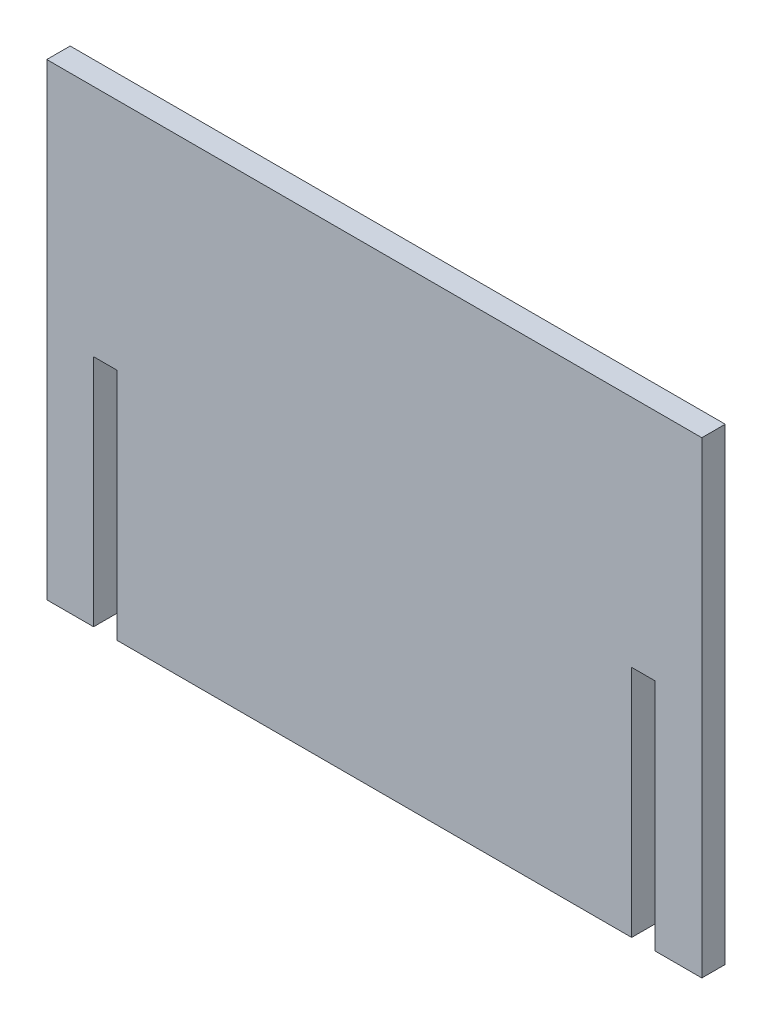
ISO-10303-21;
HEADER;
FILE_DESCRIPTION(('STEP AP214'),'2;1');
FILE_NAME('part.step','',(''),(''),'','','');
FILE_SCHEMA(('AUTOMOTIVE_DESIGN { 1 0 10303 214 1 1 1 1 }'));
ENDSEC;
DATA;
#1=APPLICATION_CONTEXT('core data for automotive mechanical design processes');
#2=APPLICATION_PROTOCOL_DEFINITION('international standard','automotive_design',2000,#1);
#3=PRODUCT_CONTEXT('',#1,'mechanical');
#4=PRODUCT('Part','Part','',(#3));
#5=PRODUCT_RELATED_PRODUCT_CATEGORY('part','',(#4));
#6=PRODUCT_DEFINITION_FORMATION('','',#4);
#7=PRODUCT_DEFINITION_CONTEXT('part definition',#1,'design');
#8=PRODUCT_DEFINITION('design','',#6,#7);
#9=PRODUCT_DEFINITION_SHAPE('','',#8);
#10=(LENGTH_UNIT() NAMED_UNIT(*) SI_UNIT(.MILLI.,.METRE.));
#11=(NAMED_UNIT(*) PLANE_ANGLE_UNIT() SI_UNIT($,.RADIAN.));
#12=(NAMED_UNIT(*) SI_UNIT($,.STERADIAN.) SOLID_ANGLE_UNIT());
#13=UNCERTAINTY_MEASURE_WITH_UNIT(LENGTH_MEASURE(1.E-05),#10,'distance_accuracy_value','');
#14=(GEOMETRIC_REPRESENTATION_CONTEXT(3) GLOBAL_UNCERTAINTY_ASSIGNED_CONTEXT((#13)) GLOBAL_UNIT_ASSIGNED_CONTEXT((#10,
#11,#12)) REPRESENTATION_CONTEXT('',''));
#15=CARTESIAN_POINT('',(0.,0.,0.));
#16=DIRECTION('',(0.,0.,1.));
#17=DIRECTION('',(1.,0.,0.));
#18=AXIS2_PLACEMENT_3D('',#15,#16,#17);
#19=CARTESIAN_POINT('',(1294.20395565763,-24.1798672236195,6.35));
#20=DIRECTION('',(1.,0.,0.));
#21=DIRECTION('',(0.,0.,-1.));
#22=AXIS2_PLACEMENT_3D('',#19,#20,#21);
#23=PLANE('',#22);
#24=DIRECTION('',(0.,-1.,0.));
#25=VECTOR('',#24,1.);
#26=CARTESIAN_POINT('',(1294.20395565763,-24.1798672236195,-6.35));
#27=LINE('',#26,#25);
#28=CARTESIAN_POINT('',(1294.20395565763,-24.1798672236195,-6.35));
#29=VERTEX_POINT('',#28);
#30=CARTESIAN_POINT('',(1294.20395565763,-278.17986722362,-6.35));
#31=VERTEX_POINT('',#30);
#32=EDGE_CURVE('E196',#29,#31,#27,.T.);
#33=ORIENTED_EDGE('',*,*,#32,.T.);
#34=DIRECTION('',(0.,0.,-1.));
#35=VECTOR('',#34,1.);
#36=CARTESIAN_POINT('',(1294.20395565763,-278.17986722362,6.35));
#37=LINE('',#36,#35);
#38=CARTESIAN_POINT('',(1294.20395565763,-278.17986722362,6.35));
#39=VERTEX_POINT('',#38);
#40=EDGE_CURVE('E11',#39,#31,#37,.T.);
#41=ORIENTED_EDGE('',*,*,#40,.F.);
#42=DIRECTION('',(0.,-1.,0.));
#43=VECTOR('',#42,1.);
#44=CARTESIAN_POINT('',(1294.20395565763,-24.1798672236195,6.35));
#45=LINE('',#44,#43);
#46=CARTESIAN_POINT('',(1294.20395565763,-24.1798672236195,6.35));
#47=VERTEX_POINT('',#46);
#48=EDGE_CURVE('E230',#47,#39,#45,.T.);
#49=ORIENTED_EDGE('',*,*,#48,.F.);
#50=DIRECTION('',(0.,0.,-1.));
#51=VECTOR('',#50,1.);
#52=CARTESIAN_POINT('',(1294.20395565763,-24.1798672236195,6.35));
#53=LINE('',#52,#51);
#54=EDGE_CURVE('E192',#47,#29,#53,.T.);
#55=ORIENTED_EDGE('',*,*,#54,.T.);
#56=EDGE_LOOP('',(#33,#41,#49,#55));
#57=FACE_BOUND('',#56,.T.);
#58=ADVANCED_FACE('F47',(#57),#23,.F.);
#59=CARTESIAN_POINT('',(1294.20395565763,-278.17986722362,6.35));
#60=DIRECTION('',(0.,1.,0.));
#61=DIRECTION('',(0.,0.,1.));
#62=AXIS2_PLACEMENT_3D('',#59,#60,#61);
#63=PLANE('',#62);
#64=DIRECTION('',(1.,0.,0.));
#65=VECTOR('',#64,1.);
#66=CARTESIAN_POINT('',(1294.20395565763,-278.17986722362,-6.35));
#67=LINE('',#66,#65);
#68=CARTESIAN_POINT('',(1319.60395565763,-278.17986722362,-6.35));
#69=VERTEX_POINT('',#68);
#70=EDGE_CURVE('E200',#31,#69,#67,.T.);
#71=ORIENTED_EDGE('',*,*,#70,.T.);
#72=DIRECTION('',(0.,0.,-1.));
#73=VECTOR('',#72,1.);
#74=CARTESIAN_POINT('',(1319.60395565763,-278.17986722362,6.35));
#75=LINE('',#74,#73);
#76=CARTESIAN_POINT('',(1319.60395565763,-278.17986722362,6.35));
#77=VERTEX_POINT('',#76);
#78=EDGE_CURVE('E56',#77,#69,#75,.T.);
#79=ORIENTED_EDGE('',*,*,#78,.F.);
#80=DIRECTION('',(1.,0.,0.));
#81=VECTOR('',#80,1.);
#82=CARTESIAN_POINT('',(1294.20395565763,-278.17986722362,6.35));
#83=LINE('',#82,#81);
#84=EDGE_CURVE('E135',#39,#77,#83,.T.);
#85=ORIENTED_EDGE('',*,*,#84,.F.);
#86=ORIENTED_EDGE('',*,*,#40,.T.);
#87=EDGE_LOOP('',(#71,#79,#85,#86));
#88=FACE_BOUND('',#87,.T.);
#89=ADVANCED_FACE('F324',(#88),#63,.F.);
#90=CARTESIAN_POINT('',(1319.60395565763,-278.17986722362,6.35));
#91=DIRECTION('',(-1.,0.,0.));
#92=DIRECTION('',(0.,0.,1.));
#93=AXIS2_PLACEMENT_3D('',#90,#91,#92);
#94=PLANE('',#93);
#95=DIRECTION('',(0.,1.,0.));
#96=VECTOR('',#95,1.);
#97=CARTESIAN_POINT('',(1319.60395565763,-278.17986722362,-6.35));
#98=LINE('',#97,#96);
#99=CARTESIAN_POINT('',(1319.60395565763,-151.17986722362,-6.35));
#100=VERTEX_POINT('',#99);
#101=EDGE_CURVE('E203',#69,#100,#98,.T.);
#102=ORIENTED_EDGE('',*,*,#101,.T.);
#103=DIRECTION('',(0.,0.,-1.));
#104=VECTOR('',#103,1.);
#105=CARTESIAN_POINT('',(1319.60395565763,-151.17986722362,6.35));
#106=LINE('',#105,#104);
#107=CARTESIAN_POINT('',(1319.60395565763,-151.17986722362,6.35));
#108=VERTEX_POINT('',#107);
#109=EDGE_CURVE('E257',#108,#100,#106,.T.);
#110=ORIENTED_EDGE('',*,*,#109,.F.);
#111=DIRECTION('',(0.,1.,0.));
#112=VECTOR('',#111,1.);
#113=CARTESIAN_POINT('',(1319.60395565763,-278.17986722362,6.35));
#114=LINE('',#113,#112);
#115=EDGE_CURVE('E267',#77,#108,#114,.T.);
#116=ORIENTED_EDGE('',*,*,#115,.F.);
#117=ORIENTED_EDGE('',*,*,#78,.T.);
#118=EDGE_LOOP('',(#102,#110,#116,#117));
#119=FACE_BOUND('',#118,.T.);
#120=ADVANCED_FACE('F265',(#119),#94,.F.);
#121=CARTESIAN_POINT('',(1319.60395565763,-151.17986722362,6.35));
#122=DIRECTION('',(0.,1.,0.));
#123=DIRECTION('',(0.,0.,1.));
#124=AXIS2_PLACEMENT_3D('',#121,#122,#123);
#125=PLANE('',#124);
#126=DIRECTION('',(1.,0.,0.));
#127=VECTOR('',#126,1.);
#128=CARTESIAN_POINT('',(1319.60395565763,-151.17986722362,-6.35));
#129=LINE('',#128,#127);
#130=CARTESIAN_POINT('',(1332.30395565763,-151.17986722362,-6.35));
#131=VERTEX_POINT('',#130);
#132=EDGE_CURVE('E206',#100,#131,#129,.T.);
#133=ORIENTED_EDGE('',*,*,#132,.T.);
#134=DIRECTION('',(0.,0.,-1.));
#135=VECTOR('',#134,1.);
#136=CARTESIAN_POINT('',(1332.30395565763,-151.17986722362,6.35));
#137=LINE('',#136,#135);
#138=CARTESIAN_POINT('',(1332.30395565763,-151.17986722362,6.35));
#139=VERTEX_POINT('',#138);
#140=EDGE_CURVE('E253',#139,#131,#137,.T.);
#141=ORIENTED_EDGE('',*,*,#140,.F.);
#142=DIRECTION('',(1.,0.,0.));
#143=VECTOR('',#142,1.);
#144=CARTESIAN_POINT('',(1319.60395565763,-151.17986722362,6.35));
#145=LINE('',#144,#143);
#146=EDGE_CURVE('E286',#108,#139,#145,.T.);
#147=ORIENTED_EDGE('',*,*,#146,.F.);
#148=ORIENTED_EDGE('',*,*,#109,.T.);
#149=EDGE_LOOP('',(#133,#141,#147,#148));
#150=FACE_BOUND('',#149,.T.);
#151=ADVANCED_FACE('F276',(#150),#125,.F.);
#152=CARTESIAN_POINT('',(1332.30395565763,-151.17986722362,6.35));
#153=DIRECTION('',(1.,0.,0.));
#154=DIRECTION('',(0.,0.,-1.));
#155=AXIS2_PLACEMENT_3D('',#152,#153,#154);
#156=PLANE('',#155);
#157=DIRECTION('',(0.,-1.,0.));
#158=VECTOR('',#157,1.);
#159=CARTESIAN_POINT('',(1332.30395565763,-151.17986722362,-6.35));
#160=LINE('',#159,#158);
#161=CARTESIAN_POINT('',(1332.30395565763,-278.17986722362,-6.35));
#162=VERTEX_POINT('',#161);
#163=EDGE_CURVE('E209',#131,#162,#160,.T.);
#164=ORIENTED_EDGE('',*,*,#163,.T.);
#165=DIRECTION('',(0.,0.,-1.));
#166=VECTOR('',#165,1.);
#167=CARTESIAN_POINT('',(1332.30395565763,-278.17986722362,6.35));
#168=LINE('',#167,#166);
#169=CARTESIAN_POINT('',(1332.30395565763,-278.17986722362,6.35));
#170=VERTEX_POINT('',#169);
#171=EDGE_CURVE('E249',#170,#162,#168,.T.);
#172=ORIENTED_EDGE('',*,*,#171,.F.);
#173=DIRECTION('',(0.,-1.,0.));
#174=VECTOR('',#173,1.);
#175=CARTESIAN_POINT('',(1332.30395565763,-151.17986722362,6.35));
#176=LINE('',#175,#174);
#177=EDGE_CURVE('E282',#139,#170,#176,.T.);
#178=ORIENTED_EDGE('',*,*,#177,.F.);
#179=ORIENTED_EDGE('',*,*,#140,.T.);
#180=EDGE_LOOP('',(#164,#172,#178,#179));
#181=FACE_BOUND('',#180,.T.);
#182=ADVANCED_FACE('F280',(#181),#156,.F.);
#183=CARTESIAN_POINT('',(1332.30395565763,-278.17986722362,6.35));
#184=DIRECTION('',(0.,1.,0.));
#185=DIRECTION('',(0.,0.,1.));
#186=AXIS2_PLACEMENT_3D('',#183,#184,#185);
#187=PLANE('',#186);
#188=DIRECTION('',(1.,0.,0.));
#189=VECTOR('',#188,1.);
#190=CARTESIAN_POINT('',(1332.30395565763,-278.17986722362,-6.35));
#191=LINE('',#190,#189);
#192=CARTESIAN_POINT('',(1611.70395565763,-278.17986722362,-6.35));
#193=VERTEX_POINT('',#192);
#194=EDGE_CURVE('E212',#162,#193,#191,.T.);
#195=ORIENTED_EDGE('',*,*,#194,.T.);
#196=DIRECTION('',(0.,0.,-1.));
#197=VECTOR('',#196,1.);
#198=CARTESIAN_POINT('',(1611.70395565763,-278.17986722362,6.35));
#199=LINE('',#198,#197);
#200=CARTESIAN_POINT('',(1611.70395565763,-278.17986722362,6.35));
#201=VERTEX_POINT('',#200);
#202=EDGE_CURVE('E245',#201,#193,#199,.T.);
#203=ORIENTED_EDGE('',*,*,#202,.F.);
#204=DIRECTION('',(1.,0.,0.));
#205=VECTOR('',#204,1.);
#206=CARTESIAN_POINT('',(1332.30395565763,-278.17986722362,6.35));
#207=LINE('',#206,#205);
#208=EDGE_CURVE('E285',#170,#201,#207,.T.);
#209=ORIENTED_EDGE('',*,*,#208,.F.);
#210=ORIENTED_EDGE('',*,*,#171,.T.);
#211=EDGE_LOOP('',(#195,#203,#209,#210));
#212=FACE_BOUND('',#211,.T.);
#213=ADVANCED_FACE('F337',(#212),#187,.F.);
#214=CARTESIAN_POINT('',(1611.70395565763,-278.17986722362,6.35));
#215=DIRECTION('',(-1.,0.,0.));
#216=DIRECTION('',(0.,0.,1.));
#217=AXIS2_PLACEMENT_3D('',#214,#215,#216);
#218=PLANE('',#217);
#219=DIRECTION('',(0.,1.,0.));
#220=VECTOR('',#219,1.);
#221=CARTESIAN_POINT('',(1611.70395565763,-278.17986722362,-6.35));
#222=LINE('',#221,#220);
#223=CARTESIAN_POINT('',(1611.70395565763,-151.17986722362,-6.35));
#224=VERTEX_POINT('',#223);
#225=EDGE_CURVE('E215',#193,#224,#222,.T.);
#226=ORIENTED_EDGE('',*,*,#225,.T.);
#227=DIRECTION('',(0.,0.,-1.));
#228=VECTOR('',#227,1.);
#229=CARTESIAN_POINT('',(1611.70395565763,-151.17986722362,6.35));
#230=LINE('',#229,#228);
#231=CARTESIAN_POINT('',(1611.70395565763,-151.17986722362,6.35));
#232=VERTEX_POINT('',#231);
#233=EDGE_CURVE('E241',#232,#224,#230,.T.);
#234=ORIENTED_EDGE('',*,*,#233,.F.);
#235=DIRECTION('',(0.,1.,0.));
#236=VECTOR('',#235,1.);
#237=CARTESIAN_POINT('',(1611.70395565763,-278.17986722362,6.35));
#238=LINE('',#237,#236);
#239=EDGE_CURVE('E290',#201,#232,#238,.T.);
#240=ORIENTED_EDGE('',*,*,#239,.F.);
#241=ORIENTED_EDGE('',*,*,#202,.T.);
#242=EDGE_LOOP('',(#226,#234,#240,#241));
#243=FACE_BOUND('',#242,.T.);
#244=ADVANCED_FACE('F340',(#243),#218,.F.);
#245=CARTESIAN_POINT('',(1611.70395565763,-151.17986722362,6.35));
#246=DIRECTION('',(0.,1.,0.));
#247=DIRECTION('',(0.,0.,1.));
#248=AXIS2_PLACEMENT_3D('',#245,#246,#247);
#249=PLANE('',#248);
#250=DIRECTION('',(1.,0.,0.));
#251=VECTOR('',#250,1.);
#252=CARTESIAN_POINT('',(1611.70395565763,-151.17986722362,-6.35));
#253=LINE('',#252,#251);
#254=CARTESIAN_POINT('',(1624.40395565763,-151.17986722362,-6.35));
#255=VERTEX_POINT('',#254);
#256=EDGE_CURVE('E218',#224,#255,#253,.T.);
#257=ORIENTED_EDGE('',*,*,#256,.T.);
#258=DIRECTION('',(0.,0.,-1.));
#259=VECTOR('',#258,1.);
#260=CARTESIAN_POINT('',(1624.40395565763,-151.17986722362,6.35));
#261=LINE('',#260,#259);
#262=CARTESIAN_POINT('',(1624.40395565763,-151.17986722362,6.35));
#263=VERTEX_POINT('',#262);
#264=EDGE_CURVE('E237',#263,#255,#261,.T.);
#265=ORIENTED_EDGE('',*,*,#264,.F.);
#266=DIRECTION('',(1.,0.,0.));
#267=VECTOR('',#266,1.);
#268=CARTESIAN_POINT('',(1611.70395565763,-151.17986722362,6.35));
#269=LINE('',#268,#267);
#270=EDGE_CURVE('E297',#232,#263,#269,.T.);
#271=ORIENTED_EDGE('',*,*,#270,.F.);
#272=ORIENTED_EDGE('',*,*,#233,.T.);
#273=EDGE_LOOP('',(#257,#265,#271,#272));
#274=FACE_BOUND('',#273,.T.);
#275=ADVANCED_FACE('F305',(#274),#249,.F.);
#276=CARTESIAN_POINT('',(1624.40395565763,-151.17986722362,6.35));
#277=DIRECTION('',(1.,0.,0.));
#278=DIRECTION('',(0.,0.,-1.));
#279=AXIS2_PLACEMENT_3D('',#276,#277,#278);
#280=PLANE('',#279);
#281=DIRECTION('',(0.,-1.,0.));
#282=VECTOR('',#281,1.);
#283=CARTESIAN_POINT('',(1624.40395565763,-151.17986722362,-6.35));
#284=LINE('',#283,#282);
#285=CARTESIAN_POINT('',(1624.40395565763,-278.17986722362,-6.35));
#286=VERTEX_POINT('',#285);
#287=EDGE_CURVE('E221',#255,#286,#284,.T.);
#288=ORIENTED_EDGE('',*,*,#287,.T.);
#289=DIRECTION('',(0.,0.,-1.));
#290=VECTOR('',#289,1.);
#291=CARTESIAN_POINT('',(1624.40395565763,-278.17986722362,6.35));
#292=LINE('',#291,#290);
#293=CARTESIAN_POINT('',(1624.40395565763,-278.17986722362,6.35));
#294=VERTEX_POINT('',#293);
#295=EDGE_CURVE('E185',#294,#286,#292,.T.);
#296=ORIENTED_EDGE('',*,*,#295,.F.);
#297=DIRECTION('',(0.,-1.,0.));
#298=VECTOR('',#297,1.);
#299=CARTESIAN_POINT('',(1624.40395565763,-151.17986722362,6.35));
#300=LINE('',#299,#298);
#301=EDGE_CURVE('E174',#263,#294,#300,.T.);
#302=ORIENTED_EDGE('',*,*,#301,.F.);
#303=ORIENTED_EDGE('',*,*,#264,.T.);
#304=EDGE_LOOP('',(#288,#296,#302,#303));
#305=FACE_BOUND('',#304,.T.);
#306=ADVANCED_FACE('F309',(#305),#280,.F.);
#307=CARTESIAN_POINT('',(1624.40395565763,-278.17986722362,6.35));
#308=DIRECTION('',(0.,1.,0.));
#309=DIRECTION('',(0.,0.,1.));
#310=AXIS2_PLACEMENT_3D('',#307,#308,#309);
#311=PLANE('',#310);
#312=DIRECTION('',(1.,0.,0.));
#313=VECTOR('',#312,1.);
#314=CARTESIAN_POINT('',(1624.40395565763,-278.17986722362,-6.35));
#315=LINE('',#314,#313);
#316=CARTESIAN_POINT('',(1649.80395565763,-278.17986722362,-6.35));
#317=VERTEX_POINT('',#316);
#318=EDGE_CURVE('E183',#286,#317,#315,.T.);
#319=ORIENTED_EDGE('',*,*,#318,.T.);
#320=DIRECTION('',(0.,0.,-1.));
#321=VECTOR('',#320,1.);
#322=CARTESIAN_POINT('',(1649.80395565763,-278.17986722362,6.35));
#323=LINE('',#322,#321);
#324=CARTESIAN_POINT('',(1649.80395565763,-278.17986722362,6.35));
#325=VERTEX_POINT('',#324);
#326=EDGE_CURVE('E180',#325,#317,#323,.T.);
#327=ORIENTED_EDGE('',*,*,#326,.F.);
#328=DIRECTION('',(1.,0.,0.));
#329=VECTOR('',#328,1.);
#330=CARTESIAN_POINT('',(1624.40395565763,-278.17986722362,6.35));
#331=LINE('',#330,#329);
#332=EDGE_CURVE('E168',#294,#325,#331,.T.);
#333=ORIENTED_EDGE('',*,*,#332,.F.);
#334=ORIENTED_EDGE('',*,*,#295,.T.);
#335=EDGE_LOOP('',(#319,#327,#333,#334));
#336=FACE_BOUND('',#335,.T.);
#337=ADVANCED_FACE('F181',(#336),#311,.F.);
#338=CARTESIAN_POINT('',(1649.80395565763,-24.1798672236195,6.35));
#339=DIRECTION('',(-1.,0.,0.));
#340=DIRECTION('',(0.,0.,1.));
#341=AXIS2_PLACEMENT_3D('',#338,#339,#340);
#342=PLANE('',#341);
#343=DIRECTION('',(0.,1.,0.));
#344=VECTOR('',#343,1.);
#345=CARTESIAN_POINT('',(1649.80395565763,-24.1798672236195,-6.35));
#346=LINE('',#345,#344);
#347=CARTESIAN_POINT('',(1649.80395565763,-24.1798672236195,-6.35));
#348=VERTEX_POINT('',#347);
#349=EDGE_CURVE('E120',#317,#348,#346,.T.);
#350=ORIENTED_EDGE('',*,*,#349,.T.);
#351=DIRECTION('',(0.,0.,-1.));
#352=VECTOR('',#351,1.);
#353=CARTESIAN_POINT('',(1649.80395565763,-24.1798672236195,6.35));
#354=LINE('',#353,#352);
#355=CARTESIAN_POINT('',(1649.80395565763,-24.1798672236195,6.35));
#356=VERTEX_POINT('',#355);
#357=EDGE_CURVE('E186',#356,#348,#354,.T.);
#358=ORIENTED_EDGE('',*,*,#357,.F.);
#359=DIRECTION('',(0.,1.,0.));
#360=VECTOR('',#359,1.);
#361=CARTESIAN_POINT('',(1649.80395565763,-24.1798672236195,6.35));
#362=LINE('',#361,#360);
#363=EDGE_CURVE('E172',#325,#356,#362,.T.);
#364=ORIENTED_EDGE('',*,*,#363,.F.);
#365=ORIENTED_EDGE('',*,*,#326,.T.);
#366=EDGE_LOOP('',(#350,#358,#364,#365));
#367=FACE_BOUND('',#366,.T.);
#368=ADVANCED_FACE('F188',(#367),#342,.F.);
#369=CARTESIAN_POINT('',(1294.20395565763,-24.1798672236195,6.35));
#370=DIRECTION('',(0.,-1.,0.));
#371=DIRECTION('',(0.,0.,-1.));
#372=AXIS2_PLACEMENT_3D('',#369,#370,#371);
#373=PLANE('',#372);
#374=DIRECTION('',(-1.,0.,0.));
#375=VECTOR('',#374,1.);
#376=CARTESIAN_POINT('',(1294.20395565763,-24.1798672236195,-6.35));
#377=LINE('',#376,#375);
#378=EDGE_CURVE('E126',#348,#29,#377,.T.);
#379=ORIENTED_EDGE('',*,*,#378,.T.);
#380=ORIENTED_EDGE('',*,*,#54,.F.);
#381=DIRECTION('',(-1.,0.,0.));
#382=VECTOR('',#381,1.);
#383=CARTESIAN_POINT('',(1294.20395565763,-24.1798672236195,6.35));
#384=LINE('',#383,#382);
#385=EDGE_CURVE('E67',#356,#47,#384,.T.);
#386=ORIENTED_EDGE('',*,*,#385,.F.);
#387=ORIENTED_EDGE('',*,*,#357,.T.);
#388=EDGE_LOOP('',(#379,#380,#386,#387));
#389=FACE_BOUND('',#388,.T.);
#390=ADVANCED_FACE('F313',(#389),#373,.F.);
#391=CARTESIAN_POINT('',(0.,0.,6.35));
#392=DIRECTION('',(0.,0.,1.));
#393=DIRECTION('',(1.,0.,0.));
#394=AXIS2_PLACEMENT_3D('',#391,#392,#393);
#395=PLANE('',#394);
#396=ORIENTED_EDGE('',*,*,#48,.T.);
#397=ORIENTED_EDGE('',*,*,#84,.T.);
#398=ORIENTED_EDGE('',*,*,#115,.T.);
#399=ORIENTED_EDGE('',*,*,#146,.T.);
#400=ORIENTED_EDGE('',*,*,#177,.T.);
#401=ORIENTED_EDGE('',*,*,#208,.T.);
#402=ORIENTED_EDGE('',*,*,#239,.T.);
#403=ORIENTED_EDGE('',*,*,#270,.T.);
#404=ORIENTED_EDGE('',*,*,#301,.T.);
#405=ORIENTED_EDGE('',*,*,#332,.T.);
#406=ORIENTED_EDGE('',*,*,#363,.T.);
#407=ORIENTED_EDGE('',*,*,#385,.T.);
#408=EDGE_LOOP('',(#396,#397,#398,#399,#400,#401,#402,#403,#404,#405,#406,#407));
#409=FACE_BOUND('',#408,.T.);
#410=ADVANCED_FACE('F170',(#409),#395,.T.);
#411=CARTESIAN_POINT('',(0.,0.,-6.35));
#412=DIRECTION('',(0.,0.,1.));
#413=DIRECTION('',(1.,0.,0.));
#414=AXIS2_PLACEMENT_3D('',#411,#412,#413);
#415=PLANE('',#414);
#416=ORIENTED_EDGE('',*,*,#32,.F.);
#417=ORIENTED_EDGE('',*,*,#378,.F.);
#418=ORIENTED_EDGE('',*,*,#349,.F.);
#419=ORIENTED_EDGE('',*,*,#318,.F.);
#420=ORIENTED_EDGE('',*,*,#287,.F.);
#421=ORIENTED_EDGE('',*,*,#256,.F.);
#422=ORIENTED_EDGE('',*,*,#225,.F.);
#423=ORIENTED_EDGE('',*,*,#194,.F.);
#424=ORIENTED_EDGE('',*,*,#163,.F.);
#425=ORIENTED_EDGE('',*,*,#132,.F.);
#426=ORIENTED_EDGE('',*,*,#101,.F.);
#427=ORIENTED_EDGE('',*,*,#70,.F.);
#428=EDGE_LOOP('',(#416,#417,#418,#419,#420,#421,#422,#423,#424,#425,#426,#427));
#429=FACE_BOUND('',#428,.T.);
#430=ADVANCED_FACE('F271',(#429),#415,.F.);
#431=CLOSED_SHELL('',(#58,#89,#120,#151,#182,#213,#244,#275,#306,#337,#368,#390,#410,#430));
#432=MANIFOLD_SOLID_BREP('B2',#431);
#433=ADVANCED_BREP_SHAPE_REPRESENTATION('',(#18,#432),#14);
#434=SHAPE_DEFINITION_REPRESENTATION(#9,#433);
ENDSEC;
END-ISO-10303-21;
